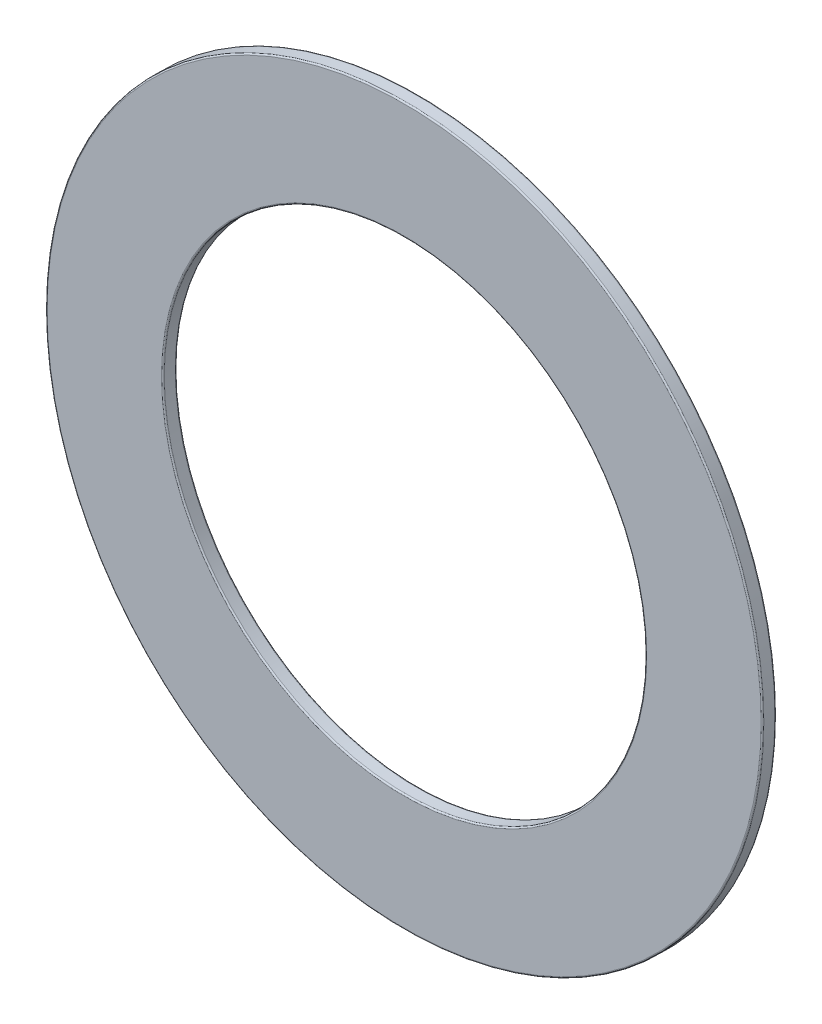
ISO-10303-21;
HEADER;
FILE_DESCRIPTION(('STEP AP214'),'2;1');
FILE_NAME('part.step','',(''),(''),'','','');
FILE_SCHEMA(('AUTOMOTIVE_DESIGN { 1 0 10303 214 1 1 1 1 }'));
ENDSEC;
DATA;
#1=APPLICATION_CONTEXT('core data for automotive mechanical design processes');
#2=APPLICATION_PROTOCOL_DEFINITION('international standard','automotive_design',2000,#1);
#3=PRODUCT_CONTEXT('',#1,'mechanical');
#4=PRODUCT('Part','Part','',(#3));
#5=PRODUCT_RELATED_PRODUCT_CATEGORY('part','',(#4));
#6=PRODUCT_DEFINITION_FORMATION('','',#4);
#7=PRODUCT_DEFINITION_CONTEXT('part definition',#1,'design');
#8=PRODUCT_DEFINITION('design','',#6,#7);
#9=PRODUCT_DEFINITION_SHAPE('','',#8);
#10=(LENGTH_UNIT() NAMED_UNIT(*) SI_UNIT(.MILLI.,.METRE.));
#11=(NAMED_UNIT(*) PLANE_ANGLE_UNIT() SI_UNIT($,.RADIAN.));
#12=(NAMED_UNIT(*) SI_UNIT($,.STERADIAN.) SOLID_ANGLE_UNIT());
#13=UNCERTAINTY_MEASURE_WITH_UNIT(LENGTH_MEASURE(1.E-05),#10,'distance_accuracy_value','');
#14=(GEOMETRIC_REPRESENTATION_CONTEXT(3) GLOBAL_UNCERTAINTY_ASSIGNED_CONTEXT((#13)) GLOBAL_UNIT_ASSIGNED_CONTEXT((#10,
#11,#12)) REPRESENTATION_CONTEXT('',''));
#15=CARTESIAN_POINT('',(0.,0.,0.));
#16=DIRECTION('',(0.,0.,1.));
#17=DIRECTION('',(1.,0.,0.));
#18=AXIS2_PLACEMENT_3D('',#15,#16,#17);
#19=CARTESIAN_POINT('',(0.,0.,0.1));
#20=DIRECTION('',(0.,0.,1.));
#21=DIRECTION('',(0.,-1.,0.));
#22=AXIS2_PLACEMENT_3D('',#19,#20,#21);
#23=TOROIDAL_SURFACE('',#22,25.9,0.1);
#24=CARTESIAN_POINT('',(0.,0.,0.));
#25=DIRECTION('',(0.,0.,1.));
#26=DIRECTION('',(1.,0.,0.));
#27=AXIS2_PLACEMENT_3D('',#24,#25,#26);
#28=CIRCLE('',#27,25.9);
#29=CARTESIAN_POINT('',(25.9,0.,0.));
#30=VERTEX_POINT('',#29);
#31=EDGE_CURVE('E11',#30,#30,#28,.T.);
#32=ORIENTED_EDGE('',*,*,#31,.T.);
#33=EDGE_LOOP('',(#32));
#34=FACE_BOUND('',#33,.T.);
#35=CARTESIAN_POINT('',(0.,0.,0.1));
#36=DIRECTION('',(0.,0.,-1.));
#37=DIRECTION('',(1.,0.,0.));
#38=AXIS2_PLACEMENT_3D('',#35,#36,#37);
#39=CIRCLE('',#38,26.);
#40=CARTESIAN_POINT('',(26.,0.,0.1));
#41=VERTEX_POINT('',#40);
#42=EDGE_CURVE('E57',#41,#41,#39,.T.);
#43=ORIENTED_EDGE('',*,*,#42,.T.);
#44=EDGE_LOOP('',(#43));
#45=FACE_BOUND('',#44,.T.);
#46=ADVANCED_FACE('F17',(#34,#45),#23,.T.);
#47=CARTESIAN_POINT('',(-21.75,0.,0.));
#48=DIRECTION('',(0.,0.,-1.));
#49=DIRECTION('',(0.,-1.,0.));
#50=AXIS2_PLACEMENT_3D('',#47,#48,#49);
#51=PLANE('',#50);
#52=CARTESIAN_POINT('',(0.,0.,0.));
#53=DIRECTION('',(0.,0.,-1.));
#54=DIRECTION('',(1.,0.,0.));
#55=AXIS2_PLACEMENT_3D('',#52,#53,#54);
#56=CIRCLE('',#55,17.6);
#57=CARTESIAN_POINT('',(17.6,0.,0.));
#58=VERTEX_POINT('',#57);
#59=EDGE_CURVE('E28',#58,#58,#56,.T.);
#60=ORIENTED_EDGE('',*,*,#59,.F.);
#61=EDGE_LOOP('',(#60));
#62=FACE_BOUND('',#61,.T.);
#63=ORIENTED_EDGE('',*,*,#31,.F.);
#64=EDGE_LOOP('',(#63));
#65=FACE_BOUND('',#64,.T.);
#66=ADVANCED_FACE('F119',(#62,#65),#51,.T.);
#67=CARTESIAN_POINT('',(0.,0.,0.1));
#68=DIRECTION('',(0.,0.,1.));
#69=DIRECTION('',(0.,-1.,0.));
#70=AXIS2_PLACEMENT_3D('',#67,#68,#69);
#71=TOROIDAL_SURFACE('',#70,17.6,0.1);
#72=CARTESIAN_POINT('',(0.,0.,0.1));
#73=DIRECTION('',(0.,0.,1.));
#74=DIRECTION('',(1.,0.,0.));
#75=AXIS2_PLACEMENT_3D('',#72,#73,#74);
#76=CIRCLE('',#75,17.5);
#77=CARTESIAN_POINT('',(17.5,0.,0.1));
#78=VERTEX_POINT('',#77);
#79=EDGE_CURVE('E89',#78,#78,#76,.T.);
#80=ORIENTED_EDGE('',*,*,#79,.T.);
#81=EDGE_LOOP('',(#80));
#82=FACE_BOUND('',#81,.T.);
#83=ORIENTED_EDGE('',*,*,#59,.T.);
#84=EDGE_LOOP('',(#83));
#85=FACE_BOUND('',#84,.T.);
#86=ADVANCED_FACE('F19',(#82,#85),#71,.T.);
#87=CARTESIAN_POINT('',(0.,0.,0.5));
#88=DIRECTION('',(0.,0.,1.));
#89=DIRECTION('',(-1.,0.,0.));
#90=AXIS2_PLACEMENT_3D('',#87,#88,#89);
#91=CYLINDRICAL_SURFACE('',#90,17.5);
#92=ORIENTED_EDGE('',*,*,#79,.F.);
#93=EDGE_LOOP('',(#92));
#94=FACE_BOUND('',#93,.T.);
#95=CARTESIAN_POINT('',(0.,0.,0.9));
#96=DIRECTION('',(0.,0.,-1.));
#97=DIRECTION('',(1.,0.,0.));
#98=AXIS2_PLACEMENT_3D('',#95,#96,#97);
#99=CIRCLE('',#98,17.5);
#100=CARTESIAN_POINT('',(17.5,0.,0.9));
#101=VERTEX_POINT('',#100);
#102=EDGE_CURVE('E88',#101,#101,#99,.T.);
#103=ORIENTED_EDGE('',*,*,#102,.F.);
#104=EDGE_LOOP('',(#103));
#105=FACE_BOUND('',#104,.T.);
#106=ADVANCED_FACE('F100',(#94,#105),#91,.F.);
#107=CARTESIAN_POINT('',(0.,0.,0.9));
#108=DIRECTION('',(0.,0.,1.));
#109=DIRECTION('',(0.,-1.,0.));
#110=AXIS2_PLACEMENT_3D('',#107,#108,#109);
#111=TOROIDAL_SURFACE('',#110,17.6,0.1);
#112=CARTESIAN_POINT('',(0.,0.,1.));
#113=DIRECTION('',(0.,0.,1.));
#114=DIRECTION('',(1.,0.,0.));
#115=AXIS2_PLACEMENT_3D('',#112,#113,#114);
#116=CIRCLE('',#115,17.6);
#117=CARTESIAN_POINT('',(17.6,0.,1.));
#118=VERTEX_POINT('',#117);
#119=EDGE_CURVE('E66',#118,#118,#116,.T.);
#120=ORIENTED_EDGE('',*,*,#119,.T.);
#121=EDGE_LOOP('',(#120));
#122=FACE_BOUND('',#121,.T.);
#123=ORIENTED_EDGE('',*,*,#102,.T.);
#124=EDGE_LOOP('',(#123));
#125=FACE_BOUND('',#124,.T.);
#126=ADVANCED_FACE('F103',(#122,#125),#111,.T.);
#127=CARTESIAN_POINT('',(0.,0.,0.5));
#128=DIRECTION('',(0.,0.,1.));
#129=DIRECTION('',(-1.,0.,0.));
#130=AXIS2_PLACEMENT_3D('',#127,#128,#129);
#131=CYLINDRICAL_SURFACE('',#130,26.);
#132=ORIENTED_EDGE('',*,*,#42,.F.);
#133=EDGE_LOOP('',(#132));
#134=FACE_BOUND('',#133,.T.);
#135=CARTESIAN_POINT('',(0.,0.,0.9));
#136=DIRECTION('',(0.,0.,1.));
#137=DIRECTION('',(1.,0.,0.));
#138=AXIS2_PLACEMENT_3D('',#135,#136,#137);
#139=CIRCLE('',#138,26.);
#140=CARTESIAN_POINT('',(26.,0.,0.9));
#141=VERTEX_POINT('',#140);
#142=EDGE_CURVE('E21',#141,#141,#139,.T.);
#143=ORIENTED_EDGE('',*,*,#142,.F.);
#144=EDGE_LOOP('',(#143));
#145=FACE_BOUND('',#144,.T.);
#146=ADVANCED_FACE('F108',(#134,#145),#131,.T.);
#147=CARTESIAN_POINT('',(-21.75,0.,1.));
#148=DIRECTION('',(0.,0.,1.));
#149=DIRECTION('',(1.,0.,0.));
#150=AXIS2_PLACEMENT_3D('',#147,#148,#149);
#151=PLANE('',#150);
#152=ORIENTED_EDGE('',*,*,#119,.F.);
#153=EDGE_LOOP('',(#152));
#154=FACE_BOUND('',#153,.T.);
#155=CARTESIAN_POINT('',(0.,0.,1.));
#156=DIRECTION('',(0.,0.,-1.));
#157=DIRECTION('',(1.,0.,0.));
#158=AXIS2_PLACEMENT_3D('',#155,#156,#157);
#159=CIRCLE('',#158,25.9);
#160=CARTESIAN_POINT('',(25.9,0.,1.));
#161=VERTEX_POINT('',#160);
#162=EDGE_CURVE('E76',#161,#161,#159,.T.);
#163=ORIENTED_EDGE('',*,*,#162,.F.);
#164=EDGE_LOOP('',(#163));
#165=FACE_BOUND('',#164,.T.);
#166=ADVANCED_FACE('F114',(#154,#165),#151,.T.);
#167=CARTESIAN_POINT('',(0.,0.,0.9));
#168=DIRECTION('',(0.,0.,1.));
#169=DIRECTION('',(0.,-1.,0.));
#170=AXIS2_PLACEMENT_3D('',#167,#168,#169);
#171=TOROIDAL_SURFACE('',#170,25.9,0.1);
#172=ORIENTED_EDGE('',*,*,#142,.T.);
#173=EDGE_LOOP('',(#172));
#174=FACE_BOUND('',#173,.T.);
#175=ORIENTED_EDGE('',*,*,#162,.T.);
#176=EDGE_LOOP('',(#175));
#177=FACE_BOUND('',#176,.T.);
#178=ADVANCED_FACE('F72',(#174,#177),#171,.T.);
#179=CLOSED_SHELL('',(#46,#66,#86,#106,#126,#146,#166,#178));
#180=MANIFOLD_SOLID_BREP('B1',#179);
#181=ADVANCED_BREP_SHAPE_REPRESENTATION('',(#18,#180),#14);
#182=SHAPE_DEFINITION_REPRESENTATION(#9,#181);
ENDSEC;
END-ISO-10303-21;
